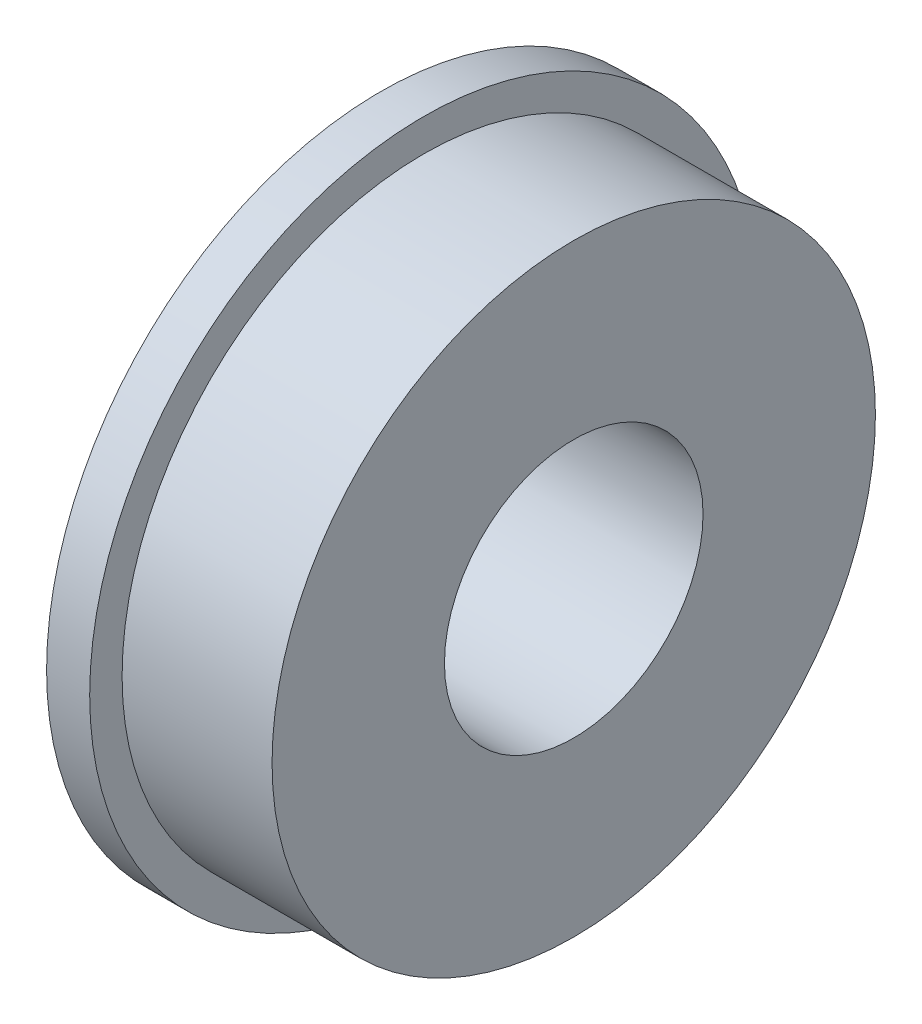
ISO-10303-21;
HEADER;
FILE_DESCRIPTION(('STEP AP214'),'2;1');
FILE_NAME('part.step','',(''),(''),'','','');
FILE_SCHEMA(('AUTOMOTIVE_DESIGN { 1 0 10303 214 1 1 1 1 }'));
ENDSEC;
DATA;
#1=APPLICATION_CONTEXT('core data for automotive mechanical design processes');
#2=APPLICATION_PROTOCOL_DEFINITION('international standard','automotive_design',2000,#1);
#3=PRODUCT_CONTEXT('',#1,'mechanical');
#4=PRODUCT('Part','Part','',(#3));
#5=PRODUCT_RELATED_PRODUCT_CATEGORY('part','',(#4));
#6=PRODUCT_DEFINITION_FORMATION('','',#4);
#7=PRODUCT_DEFINITION_CONTEXT('part definition',#1,'design');
#8=PRODUCT_DEFINITION('design','',#6,#7);
#9=PRODUCT_DEFINITION_SHAPE('','',#8);
#10=(LENGTH_UNIT() NAMED_UNIT(*) SI_UNIT(.MILLI.,.METRE.));
#11=(NAMED_UNIT(*) PLANE_ANGLE_UNIT() SI_UNIT($,.RADIAN.));
#12=(NAMED_UNIT(*) SI_UNIT($,.STERADIAN.) SOLID_ANGLE_UNIT());
#13=UNCERTAINTY_MEASURE_WITH_UNIT(LENGTH_MEASURE(1.E-05),#10,'distance_accuracy_value','');
#14=(GEOMETRIC_REPRESENTATION_CONTEXT(3) GLOBAL_UNCERTAINTY_ASSIGNED_CONTEXT((#13)) GLOBAL_UNIT_ASSIGNED_CONTEXT((#10,
#11,#12)) REPRESENTATION_CONTEXT('',''));
#15=CARTESIAN_POINT('',(0.,0.,0.));
#16=DIRECTION('',(0.,0.,1.));
#17=DIRECTION('',(1.,0.,0.));
#18=AXIS2_PLACEMENT_3D('',#15,#16,#17);
#19=CARTESIAN_POINT('',(0.,0.,0.));
#20=DIRECTION('',(-1.,0.,0.));
#21=DIRECTION('',(0.,0.,1.));
#22=AXIS2_PLACEMENT_3D('',#19,#20,#21);
#23=CYLINDRICAL_SURFACE('',#22,9.906);
#24=CARTESIAN_POINT('',(0.381,0.,0.));
#25=DIRECTION('',(-1.,0.,0.));
#26=DIRECTION('',(0.,0.,1.));
#27=AXIS2_PLACEMENT_3D('',#24,#25,#26);
#28=CIRCLE('',#27,9.906);
#29=CARTESIAN_POINT('',(0.381,0.,9.906));
#30=VERTEX_POINT('',#29);
#31=EDGE_CURVE('E44',#30,#30,#28,.F.);
#32=ORIENTED_EDGE('',*,*,#31,.T.);
#33=EDGE_LOOP('',(#32));
#34=FACE_BOUND('',#33,.T.);
#35=CARTESIAN_POINT('',(0.,0.,0.));
#36=DIRECTION('',(-1.,0.,0.));
#37=DIRECTION('',(0.,0.,1.));
#38=AXIS2_PLACEMENT_3D('',#35,#36,#37);
#39=CIRCLE('',#38,9.906);
#40=CARTESIAN_POINT('',(0.,0.,9.906));
#41=VERTEX_POINT('',#40);
#42=EDGE_CURVE('E16',#41,#41,#39,.T.);
#43=ORIENTED_EDGE('',*,*,#42,.T.);
#44=EDGE_LOOP('',(#43));
#45=FACE_BOUND('',#44,.T.);
#46=ADVANCED_FACE('F13',(#34,#45),#23,.F.);
#47=CARTESIAN_POINT('',(0.,12.3063,0.));
#48=DIRECTION('',(1.,0.,0.));
#49=DIRECTION('',(0.,0.,-1.));
#50=AXIS2_PLACEMENT_3D('',#47,#48,#49);
#51=PLANE('',#50);
#52=CARTESIAN_POINT('',(0.,0.,0.));
#53=DIRECTION('',(-1.,0.,0.));
#54=DIRECTION('',(0.,0.,1.));
#55=AXIS2_PLACEMENT_3D('',#52,#53,#54);
#56=CIRCLE('',#55,12.3063);
#57=CARTESIAN_POINT('',(0.,0.,12.3063));
#58=VERTEX_POINT('',#57);
#59=EDGE_CURVE('E42',#58,#58,#56,.F.);
#60=ORIENTED_EDGE('',*,*,#59,.F.);
#61=EDGE_LOOP('',(#60));
#62=FACE_BOUND('',#61,.T.);
#63=ORIENTED_EDGE('',*,*,#42,.F.);
#64=EDGE_LOOP('',(#63));
#65=FACE_BOUND('',#64,.T.);
#66=ADVANCED_FACE('F52',(#62,#65),#51,.F.);
#67=CARTESIAN_POINT('',(0.381,9.906,0.));
#68=DIRECTION('',(1.,0.,0.));
#69=DIRECTION('',(0.,0.,-1.));
#70=AXIS2_PLACEMENT_3D('',#67,#68,#69);
#71=PLANE('',#70);
#72=ORIENTED_EDGE('',*,*,#31,.F.);
#73=EDGE_LOOP('',(#72));
#74=FACE_BOUND('',#73,.T.);
#75=CARTESIAN_POINT('',(0.381,0.,0.));
#76=DIRECTION('',(-1.,0.,0.));
#77=DIRECTION('',(0.,0.,1.));
#78=AXIS2_PLACEMENT_3D('',#75,#76,#77);
#79=CIRCLE('',#78,6.35);
#80=CARTESIAN_POINT('',(0.381,0.,6.35));
#81=VERTEX_POINT('',#80);
#82=EDGE_CURVE('E39',#81,#81,#79,.T.);
#83=ORIENTED_EDGE('',*,*,#82,.F.);
#84=EDGE_LOOP('',(#83));
#85=FACE_BOUND('',#84,.T.);
#86=ADVANCED_FACE('F54',(#74,#85),#71,.F.);
#87=CARTESIAN_POINT('',(0.,0.,0.));
#88=DIRECTION('',(-1.,0.,0.));
#89=DIRECTION('',(0.,0.,1.));
#90=AXIS2_PLACEMENT_3D('',#87,#88,#89);
#91=CYLINDRICAL_SURFACE('',#90,12.3063);
#92=ORIENTED_EDGE('',*,*,#59,.T.);
#93=EDGE_LOOP('',(#92));
#94=FACE_BOUND('',#93,.T.);
#95=CARTESIAN_POINT('',(1.5875,0.,0.));
#96=DIRECTION('',(-1.,0.,0.));
#97=DIRECTION('',(0.,0.,1.));
#98=AXIS2_PLACEMENT_3D('',#95,#96,#97);
#99=CIRCLE('',#98,12.3063);
#100=CARTESIAN_POINT('',(1.5875,0.,12.3063));
#101=VERTEX_POINT('',#100);
#102=EDGE_CURVE('E36',#101,#101,#99,.T.);
#103=ORIENTED_EDGE('',*,*,#102,.T.);
#104=EDGE_LOOP('',(#103));
#105=FACE_BOUND('',#104,.T.);
#106=ADVANCED_FACE('F61',(#94,#105),#91,.T.);
#107=CARTESIAN_POINT('',(0.,0.,0.));
#108=DIRECTION('',(-1.,0.,0.));
#109=DIRECTION('',(0.,0.,1.));
#110=AXIS2_PLACEMENT_3D('',#107,#108,#109);
#111=CYLINDRICAL_SURFACE('',#110,6.35);
#112=CARTESIAN_POINT('',(0.,0.,0.));
#113=DIRECTION('',(-1.,0.,0.));
#114=DIRECTION('',(0.,0.,1.));
#115=AXIS2_PLACEMENT_3D('',#112,#113,#114);
#116=CIRCLE('',#115,6.35);
#117=CARTESIAN_POINT('',(0.,0.,6.35));
#118=VERTEX_POINT('',#117);
#119=EDGE_CURVE('E33',#118,#118,#116,.F.);
#120=ORIENTED_EDGE('',*,*,#119,.T.);
#121=EDGE_LOOP('',(#120));
#122=FACE_BOUND('',#121,.T.);
#123=ORIENTED_EDGE('',*,*,#82,.T.);
#124=EDGE_LOOP('',(#123));
#125=FACE_BOUND('',#124,.T.);
#126=ADVANCED_FACE('F87',(#122,#125),#111,.T.);
#127=CARTESIAN_POINT('',(1.5875,11.1125,0.));
#128=DIRECTION('',(-1.,0.,0.));
#129=DIRECTION('',(0.,0.,1.));
#130=AXIS2_PLACEMENT_3D('',#127,#128,#129);
#131=PLANE('',#130);
#132=CARTESIAN_POINT('',(1.5875,0.,0.));
#133=DIRECTION('',(-1.,0.,0.));
#134=DIRECTION('',(0.,0.,1.));
#135=AXIS2_PLACEMENT_3D('',#132,#133,#134);
#136=CIRCLE('',#135,11.1125);
#137=CARTESIAN_POINT('',(1.5875,0.,11.1125));
#138=VERTEX_POINT('',#137);
#139=EDGE_CURVE('E30',#138,#138,#136,.F.);
#140=ORIENTED_EDGE('',*,*,#139,.F.);
#141=EDGE_LOOP('',(#140));
#142=FACE_BOUND('',#141,.T.);
#143=ORIENTED_EDGE('',*,*,#102,.F.);
#144=EDGE_LOOP('',(#143));
#145=FACE_BOUND('',#144,.T.);
#146=ADVANCED_FACE('F83',(#142,#145),#131,.F.);
#147=CARTESIAN_POINT('',(0.,6.35,0.));
#148=DIRECTION('',(1.,0.,0.));
#149=DIRECTION('',(0.,0.,-1.));
#150=AXIS2_PLACEMENT_3D('',#147,#148,#149);
#151=PLANE('',#150);
#152=ORIENTED_EDGE('',*,*,#119,.F.);
#153=EDGE_LOOP('',(#152));
#154=FACE_BOUND('',#153,.T.);
#155=CARTESIAN_POINT('',(0.,0.,0.));
#156=DIRECTION('',(-1.,0.,0.));
#157=DIRECTION('',(0.,0.,1.));
#158=AXIS2_PLACEMENT_3D('',#155,#156,#157);
#159=CIRCLE('',#158,4.7625);
#160=CARTESIAN_POINT('',(0.,0.,4.7625));
#161=VERTEX_POINT('',#160);
#162=EDGE_CURVE('E25',#161,#161,#159,.F.);
#163=ORIENTED_EDGE('',*,*,#162,.T.);
#164=EDGE_LOOP('',(#163));
#165=FACE_BOUND('',#164,.T.);
#166=ADVANCED_FACE('F79',(#154,#165),#151,.F.);
#167=CARTESIAN_POINT('',(0.,0.,0.));
#168=DIRECTION('',(-1.,0.,0.));
#169=DIRECTION('',(0.,0.,1.));
#170=AXIS2_PLACEMENT_3D('',#167,#168,#169);
#171=CYLINDRICAL_SURFACE('',#170,11.1125);
#172=ORIENTED_EDGE('',*,*,#139,.T.);
#173=EDGE_LOOP('',(#172));
#174=FACE_BOUND('',#173,.T.);
#175=CARTESIAN_POINT('',(7.112,0.,0.));
#176=DIRECTION('',(-1.,0.,0.));
#177=DIRECTION('',(0.,0.,1.));
#178=AXIS2_PLACEMENT_3D('',#175,#176,#177);
#179=CIRCLE('',#178,11.1125);
#180=CARTESIAN_POINT('',(7.112,0.,11.1125));
#181=VERTEX_POINT('',#180);
#182=EDGE_CURVE('E20',#181,#181,#179,.T.);
#183=ORIENTED_EDGE('',*,*,#182,.T.);
#184=EDGE_LOOP('',(#183));
#185=FACE_BOUND('',#184,.T.);
#186=ADVANCED_FACE('F73',(#174,#185),#171,.T.);
#187=CARTESIAN_POINT('',(0.,0.,0.));
#188=DIRECTION('',(-1.,0.,0.));
#189=DIRECTION('',(0.,0.,1.));
#190=AXIS2_PLACEMENT_3D('',#187,#188,#189);
#191=CYLINDRICAL_SURFACE('',#190,4.7625);
#192=CARTESIAN_POINT('',(7.112,0.,0.));
#193=DIRECTION('',(-1.,0.,0.));
#194=DIRECTION('',(0.,0.,1.));
#195=AXIS2_PLACEMENT_3D('',#192,#193,#194);
#196=CIRCLE('',#195,4.7625);
#197=CARTESIAN_POINT('',(7.112,0.,4.7625));
#198=VERTEX_POINT('',#197);
#199=EDGE_CURVE('E9',#198,#198,#196,.F.);
#200=ORIENTED_EDGE('',*,*,#199,.T.);
#201=EDGE_LOOP('',(#200));
#202=FACE_BOUND('',#201,.T.);
#203=ORIENTED_EDGE('',*,*,#162,.F.);
#204=EDGE_LOOP('',(#203));
#205=FACE_BOUND('',#204,.T.);
#206=ADVANCED_FACE('F67',(#202,#205),#191,.F.);
#207=CARTESIAN_POINT('',(7.112,4.7625,0.));
#208=DIRECTION('',(-1.,0.,0.));
#209=DIRECTION('',(0.,0.,1.));
#210=AXIS2_PLACEMENT_3D('',#207,#208,#209);
#211=PLANE('',#210);
#212=ORIENTED_EDGE('',*,*,#199,.F.);
#213=EDGE_LOOP('',(#212));
#214=FACE_BOUND('',#213,.T.);
#215=ORIENTED_EDGE('',*,*,#182,.F.);
#216=EDGE_LOOP('',(#215));
#217=FACE_BOUND('',#216,.T.);
#218=ADVANCED_FACE('F65',(#214,#217),#211,.F.);
#219=CLOSED_SHELL('',(#46,#66,#86,#106,#126,#146,#166,#186,#206,#218));
#220=MANIFOLD_SOLID_BREP('B1',#219);
#221=ADVANCED_BREP_SHAPE_REPRESENTATION('',(#18,#220),#14);
#222=SHAPE_DEFINITION_REPRESENTATION(#9,#221);
ENDSEC;
END-ISO-10303-21;
